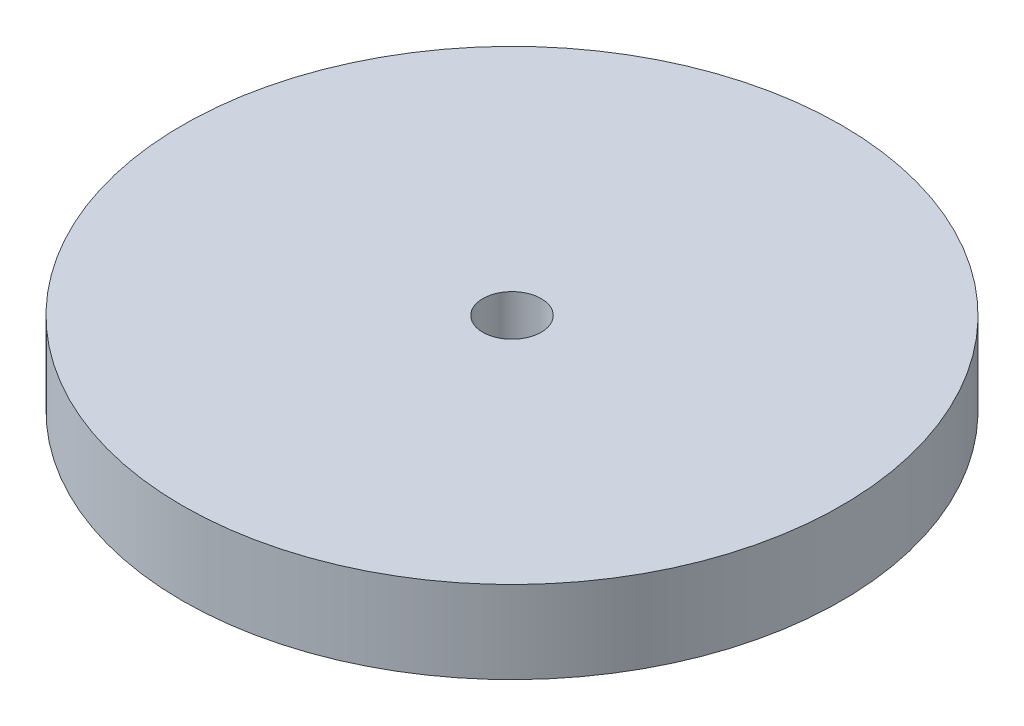
ISO-10303-21;
HEADER;
FILE_DESCRIPTION(('STEP AP214'),'2;1');
FILE_NAME('part.step','',(''),(''),'','','');
FILE_SCHEMA(('AUTOMOTIVE_DESIGN { 1 0 10303 214 1 1 1 1 }'));
ENDSEC;
DATA;
#1=APPLICATION_CONTEXT('core data for automotive mechanical design processes');
#2=APPLICATION_PROTOCOL_DEFINITION('international standard','automotive_design',2000,#1);
#3=PRODUCT_CONTEXT('',#1,'mechanical');
#4=PRODUCT('Part','Part','',(#3));
#5=PRODUCT_RELATED_PRODUCT_CATEGORY('part','',(#4));
#6=PRODUCT_DEFINITION_FORMATION('','',#4);
#7=PRODUCT_DEFINITION_CONTEXT('part definition',#1,'design');
#8=PRODUCT_DEFINITION('design','',#6,#7);
#9=PRODUCT_DEFINITION_SHAPE('','',#8);
#10=(LENGTH_UNIT() NAMED_UNIT(*) SI_UNIT(.MILLI.,.METRE.));
#11=(NAMED_UNIT(*) PLANE_ANGLE_UNIT() SI_UNIT($,.RADIAN.));
#12=(NAMED_UNIT(*) SI_UNIT($,.STERADIAN.) SOLID_ANGLE_UNIT());
#13=UNCERTAINTY_MEASURE_WITH_UNIT(LENGTH_MEASURE(1.E-05),#10,'distance_accuracy_value','');
#14=(GEOMETRIC_REPRESENTATION_CONTEXT(3) GLOBAL_UNCERTAINTY_ASSIGNED_CONTEXT((#13)) GLOBAL_UNIT_ASSIGNED_CONTEXT((#10,
#11,#12)) REPRESENTATION_CONTEXT('',''));
#15=CARTESIAN_POINT('',(0.,0.,0.));
#16=DIRECTION('',(0.,0.,1.));
#17=DIRECTION('',(1.,0.,0.));
#18=AXIS2_PLACEMENT_3D('',#15,#16,#17);
#19=CARTESIAN_POINT('',(0.,-3.175,0.));
#20=DIRECTION('',(0.,1.,0.));
#21=DIRECTION('',(0.,0.,1.));
#22=AXIS2_PLACEMENT_3D('',#19,#20,#21);
#23=CYLINDRICAL_SURFACE('',#22,12.7);
#24=CARTESIAN_POINT('',(0.,-3.175,0.));
#25=DIRECTION('',(0.,1.,0.));
#26=DIRECTION('',(0.,0.,1.));
#27=AXIS2_PLACEMENT_3D('',#24,#25,#26);
#28=CIRCLE('',#27,12.7);
#29=CARTESIAN_POINT('',(0.,-3.175,12.7));
#30=VERTEX_POINT('',#29);
#31=EDGE_CURVE('E10',#30,#30,#28,.T.);
#32=ORIENTED_EDGE('',*,*,#31,.T.);
#33=EDGE_LOOP('',(#32));
#34=FACE_BOUND('',#33,.T.);
#35=CARTESIAN_POINT('',(0.,0.,0.));
#36=DIRECTION('',(0.,1.,0.));
#37=DIRECTION('',(0.,0.,1.));
#38=AXIS2_PLACEMENT_3D('',#35,#36,#37);
#39=CIRCLE('',#38,12.7);
#40=CARTESIAN_POINT('',(0.,0.,12.7));
#41=VERTEX_POINT('',#40);
#42=EDGE_CURVE('E34',#41,#41,#39,.T.);
#43=ORIENTED_EDGE('',*,*,#42,.F.);
#44=EDGE_LOOP('',(#43));
#45=FACE_BOUND('',#44,.T.);
#46=ADVANCED_FACE('F31',(#34,#45),#23,.T.);
#47=CARTESIAN_POINT('',(0.,-3.175,0.));
#48=DIRECTION('',(0.,1.,0.));
#49=DIRECTION('',(0.,0.,1.));
#50=AXIS2_PLACEMENT_3D('',#47,#48,#49);
#51=PLANE('',#50);
#52=CARTESIAN_POINT('',(0.,-3.175,0.));
#53=DIRECTION('',(0.,1.,0.));
#54=DIRECTION('',(0.,0.,1.));
#55=AXIS2_PLACEMENT_3D('',#52,#53,#54);
#56=CIRCLE('',#55,1.125);
#57=CARTESIAN_POINT('',(0.,-3.175,1.125));
#58=VERTEX_POINT('',#57);
#59=EDGE_CURVE('E41',#58,#58,#56,.T.);
#60=ORIENTED_EDGE('',*,*,#59,.T.);
#61=EDGE_LOOP('',(#60));
#62=FACE_BOUND('',#61,.T.);
#63=ORIENTED_EDGE('',*,*,#31,.F.);
#64=EDGE_LOOP('',(#63));
#65=FACE_BOUND('',#64,.T.);
#66=ADVANCED_FACE('F49',(#62,#65),#51,.F.);
#67=CARTESIAN_POINT('',(0.,0.,0.));
#68=DIRECTION('',(0.,1.,0.));
#69=DIRECTION('',(0.,0.,1.));
#70=AXIS2_PLACEMENT_3D('',#67,#68,#69);
#71=PLANE('',#70);
#72=CARTESIAN_POINT('',(0.,0.,0.));
#73=DIRECTION('',(0.,1.,0.));
#74=DIRECTION('',(0.,0.,1.));
#75=AXIS2_PLACEMENT_3D('',#72,#73,#74);
#76=CIRCLE('',#75,1.125);
#77=CARTESIAN_POINT('',(0.,0.,1.125));
#78=VERTEX_POINT('',#77);
#79=EDGE_CURVE('E43',#78,#78,#76,.T.);
#80=ORIENTED_EDGE('',*,*,#79,.F.);
#81=EDGE_LOOP('',(#80));
#82=FACE_BOUND('',#81,.T.);
#83=ORIENTED_EDGE('',*,*,#42,.T.);
#84=EDGE_LOOP('',(#83));
#85=FACE_BOUND('',#84,.T.);
#86=ADVANCED_FACE('F55',(#82,#85),#71,.T.);
#87=CARTESIAN_POINT('',(0.,-3.175,0.));
#88=DIRECTION('',(0.,1.,0.));
#89=DIRECTION('',(0.,0.,1.));
#90=AXIS2_PLACEMENT_3D('',#87,#88,#89);
#91=CYLINDRICAL_SURFACE('',#90,1.125);
#92=ORIENTED_EDGE('',*,*,#59,.F.);
#93=EDGE_LOOP('',(#92));
#94=FACE_BOUND('',#93,.T.);
#95=ORIENTED_EDGE('',*,*,#79,.T.);
#96=EDGE_LOOP('',(#95));
#97=FACE_BOUND('',#96,.T.);
#98=ADVANCED_FACE('F52',(#94,#97),#91,.F.);
#99=CLOSED_SHELL('',(#46,#66,#86,#98));
#100=MANIFOLD_SOLID_BREP('B2',#99);
#101=ADVANCED_BREP_SHAPE_REPRESENTATION('',(#18,#100),#14);
#102=SHAPE_DEFINITION_REPRESENTATION(#9,#101);
ENDSEC;
END-ISO-10303-21;
